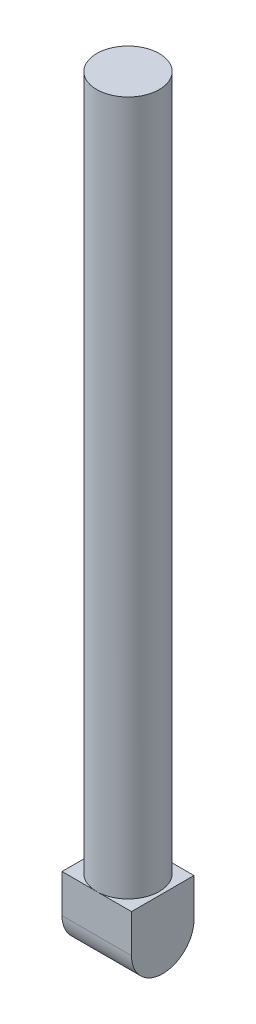
ISO-10303-21;
HEADER;
FILE_DESCRIPTION(('STEP AP214'),'2;1');
FILE_NAME('part.step','',(''),(''),'','','');
FILE_SCHEMA(('AUTOMOTIVE_DESIGN { 1 0 10303 214 1 1 1 1 }'));
ENDSEC;
DATA;
#1=APPLICATION_CONTEXT('core data for automotive mechanical design processes');
#2=APPLICATION_PROTOCOL_DEFINITION('international standard','automotive_design',2000,#1);
#3=PRODUCT_CONTEXT('',#1,'mechanical');
#4=PRODUCT('Part','Part','',(#3));
#5=PRODUCT_RELATED_PRODUCT_CATEGORY('part','',(#4));
#6=PRODUCT_DEFINITION_FORMATION('','',#4);
#7=PRODUCT_DEFINITION_CONTEXT('part definition',#1,'design');
#8=PRODUCT_DEFINITION('design','',#6,#7);
#9=PRODUCT_DEFINITION_SHAPE('','',#8);
#10=(LENGTH_UNIT() NAMED_UNIT(*) SI_UNIT(.MILLI.,.METRE.));
#11=(NAMED_UNIT(*) PLANE_ANGLE_UNIT() SI_UNIT($,.RADIAN.));
#12=(NAMED_UNIT(*) SI_UNIT($,.STERADIAN.) SOLID_ANGLE_UNIT());
#13=UNCERTAINTY_MEASURE_WITH_UNIT(LENGTH_MEASURE(1.E-05),#10,'distance_accuracy_value','');
#14=(GEOMETRIC_REPRESENTATION_CONTEXT(3) GLOBAL_UNCERTAINTY_ASSIGNED_CONTEXT((#13)) GLOBAL_UNIT_ASSIGNED_CONTEXT((#10,
#11,#12)) REPRESENTATION_CONTEXT('',''));
#15=CARTESIAN_POINT('',(0.,0.,0.));
#16=DIRECTION('',(0.,0.,1.));
#17=DIRECTION('',(1.,0.,0.));
#18=AXIS2_PLACEMENT_3D('',#15,#16,#17);
#19=CARTESIAN_POINT('',(-10.,20.,-9.));
#20=DIRECTION('',(0.,0.,1.));
#21=DIRECTION('',(1.,0.,0.));
#22=AXIS2_PLACEMENT_3D('',#19,#20,#21);
#23=PLANE('',#22);
#24=DIRECTION('',(-1.,0.,0.));
#25=VECTOR('',#24,1.);
#26=CARTESIAN_POINT('',(90.,9.,-9.00000000000002));
#27=LINE('',#26,#25);
#28=CARTESIAN_POINT('',(9.99999999999999,9.,-9.));
#29=VERTEX_POINT('',#28);
#30=CARTESIAN_POINT('',(-10.,9.,-9.));
#31=VERTEX_POINT('',#30);
#32=EDGE_CURVE('E84',#29,#31,#27,.T.);
#33=ORIENTED_EDGE('',*,*,#32,.T.);
#34=DIRECTION('',(0.,-1.,0.));
#35=VECTOR('',#34,1.);
#36=CARTESIAN_POINT('',(-10.,20.,-9.));
#37=LINE('',#36,#35);
#38=CARTESIAN_POINT('',(-10.,20.,-9.));
#39=VERTEX_POINT('',#38);
#40=EDGE_CURVE('E83',#39,#31,#37,.T.);
#41=ORIENTED_EDGE('',*,*,#40,.F.);
#42=DIRECTION('',(-1.,0.,0.));
#43=VECTOR('',#42,1.);
#44=CARTESIAN_POINT('',(-10.,20.,-9.));
#45=LINE('',#44,#43);
#46=CARTESIAN_POINT('',(0.,20.,-9.));
#47=VERTEX_POINT('',#46);
#48=EDGE_CURVE('E109',#47,#39,#45,.T.);
#49=ORIENTED_EDGE('',*,*,#48,.F.);
#50=CARTESIAN_POINT('',(10.,20.,-9.));
#51=VERTEX_POINT('',#50);
#52=EDGE_CURVE('E106',#51,#47,#45,.T.);
#53=ORIENTED_EDGE('',*,*,#52,.F.);
#54=DIRECTION('',(0.,-1.,0.));
#55=VECTOR('',#54,1.);
#56=CARTESIAN_POINT('',(10.,20.,-9.));
#57=LINE('',#56,#55);
#58=EDGE_CURVE('E99',#51,#29,#57,.T.);
#59=ORIENTED_EDGE('',*,*,#58,.T.);
#60=EDGE_LOOP('',(#33,#41,#49,#53,#59));
#61=FACE_BOUND('',#60,.T.);
#62=ADVANCED_FACE('F32',(#61),#23,.F.);
#63=CARTESIAN_POINT('',(0.,20.,0.));
#64=DIRECTION('',(0.,1.,0.));
#65=DIRECTION('',(0.,0.,1.));
#66=AXIS2_PLACEMENT_3D('',#63,#64,#65);
#67=PLANE('',#66);
#68=CARTESIAN_POINT('',(0.,20.,0.));
#69=DIRECTION('',(0.,1.,0.));
#70=DIRECTION('',(0.,0.,1.));
#71=AXIS2_PLACEMENT_3D('',#68,#69,#70);
#72=CIRCLE('',#71,9.);
#73=CARTESIAN_POINT('',(0.,20.,9.));
#74=VERTEX_POINT('',#73);
#75=EDGE_CURVE('E42',#74,#47,#72,.T.);
#76=ORIENTED_EDGE('',*,*,#75,.F.);
#77=DIRECTION('',(1.,0.,0.));
#78=VECTOR('',#77,1.);
#79=CARTESIAN_POINT('',(-10.,20.,9.));
#80=LINE('',#79,#78);
#81=CARTESIAN_POINT('',(10.,20.,9.));
#82=VERTEX_POINT('',#81);
#83=EDGE_CURVE('E113',#74,#82,#80,.T.);
#84=ORIENTED_EDGE('',*,*,#83,.T.);
#85=DIRECTION('',(0.,0.,-1.));
#86=VECTOR('',#85,1.);
#87=CARTESIAN_POINT('',(10.,20.,-9.));
#88=LINE('',#87,#86);
#89=EDGE_CURVE('E110',#82,#51,#88,.T.);
#90=ORIENTED_EDGE('',*,*,#89,.T.);
#91=ORIENTED_EDGE('',*,*,#52,.T.);
#92=EDGE_LOOP('',(#76,#84,#90,#91));
#93=FACE_BOUND('',#92,.T.);
#94=ADVANCED_FACE('F127',(#93),#67,.T.);
#95=CARTESIAN_POINT('',(-10.,20.,-9.));
#96=DIRECTION('',(1.,0.,0.));
#97=DIRECTION('',(0.,0.,-1.));
#98=AXIS2_PLACEMENT_3D('',#95,#96,#97);
#99=PLANE('',#98);
#100=ORIENTED_EDGE('',*,*,#40,.T.);
#101=CARTESIAN_POINT('',(-10.,9.,0.));
#102=DIRECTION('',(1.,0.,0.));
#103=DIRECTION('',(0.,0.,1.));
#104=AXIS2_PLACEMENT_3D('',#101,#102,#103);
#105=CIRCLE('',#104,9.);
#106=CARTESIAN_POINT('',(-10.,9.,9.));
#107=VERTEX_POINT('',#106);
#108=EDGE_CURVE('E49',#107,#31,#105,.T.);
#109=ORIENTED_EDGE('',*,*,#108,.F.);
#110=DIRECTION('',(0.,-1.,0.));
#111=VECTOR('',#110,1.);
#112=CARTESIAN_POINT('',(-10.,20.,9.));
#113=LINE('',#112,#111);
#114=CARTESIAN_POINT('',(-10.,20.,9.));
#115=VERTEX_POINT('',#114);
#116=EDGE_CURVE('E36',#115,#107,#113,.T.);
#117=ORIENTED_EDGE('',*,*,#116,.F.);
#118=DIRECTION('',(0.,0.,1.));
#119=VECTOR('',#118,1.);
#120=CARTESIAN_POINT('',(-10.,20.,-9.));
#121=LINE('',#120,#119);
#122=EDGE_CURVE('E114',#39,#115,#121,.T.);
#123=ORIENTED_EDGE('',*,*,#122,.F.);
#124=EDGE_LOOP('',(#100,#109,#117,#123));
#125=FACE_BOUND('',#124,.T.);
#126=ADVANCED_FACE('F34',(#125),#99,.F.);
#127=CARTESIAN_POINT('',(-10.,20.,9.));
#128=DIRECTION('',(0.,0.,-1.));
#129=DIRECTION('',(-1.,0.,0.));
#130=AXIS2_PLACEMENT_3D('',#127,#128,#129);
#131=PLANE('',#130);
#132=ORIENTED_EDGE('',*,*,#116,.T.);
#133=DIRECTION('',(-1.,0.,0.));
#134=VECTOR('',#133,1.);
#135=CARTESIAN_POINT('',(90.,9.,8.99999999999998));
#136=LINE('',#135,#134);
#137=CARTESIAN_POINT('',(9.99999999999999,9.,9.));
#138=VERTEX_POINT('',#137);
#139=EDGE_CURVE('E87',#138,#107,#136,.T.);
#140=ORIENTED_EDGE('',*,*,#139,.F.);
#141=DIRECTION('',(0.,-1.,0.));
#142=VECTOR('',#141,1.);
#143=CARTESIAN_POINT('',(10.,20.,9.));
#144=LINE('',#143,#142);
#145=EDGE_CURVE('E98',#82,#138,#144,.T.);
#146=ORIENTED_EDGE('',*,*,#145,.F.);
#147=ORIENTED_EDGE('',*,*,#83,.F.);
#148=EDGE_CURVE('E96',#115,#74,#80,.T.);
#149=ORIENTED_EDGE('',*,*,#148,.F.);
#150=EDGE_LOOP('',(#132,#140,#146,#147,#149));
#151=FACE_BOUND('',#150,.T.);
#152=ADVANCED_FACE('F94',(#151),#131,.F.);
#153=CARTESIAN_POINT('',(10.,20.,-9.));
#154=DIRECTION('',(-1.,0.,0.));
#155=DIRECTION('',(0.,0.,1.));
#156=AXIS2_PLACEMENT_3D('',#153,#154,#155);
#157=PLANE('',#156);
#158=ORIENTED_EDGE('',*,*,#145,.T.);
#159=CARTESIAN_POINT('',(9.99999999999999,9.,0.));
#160=DIRECTION('',(-1.,0.,0.));
#161=DIRECTION('',(0.,0.,1.));
#162=AXIS2_PLACEMENT_3D('',#159,#160,#161);
#163=CIRCLE('',#162,9.);
#164=EDGE_CURVE('E89',#138,#29,#163,.F.);
#165=ORIENTED_EDGE('',*,*,#164,.T.);
#166=ORIENTED_EDGE('',*,*,#58,.F.);
#167=ORIENTED_EDGE('',*,*,#89,.F.);
#168=EDGE_LOOP('',(#158,#165,#166,#167));
#169=FACE_BOUND('',#168,.T.);
#170=ADVANCED_FACE('F124',(#169),#157,.F.);
#171=EDGE_CURVE('E11',#47,#74,#72,.T.);
#172=ORIENTED_EDGE('',*,*,#171,.F.);
#173=ORIENTED_EDGE('',*,*,#48,.T.);
#174=ORIENTED_EDGE('',*,*,#122,.T.);
#175=ORIENTED_EDGE('',*,*,#148,.T.);
#176=EDGE_LOOP('',(#172,#173,#174,#175));
#177=FACE_BOUND('',#176,.T.);
#178=ADVANCED_FACE('F132',(#177),#67,.T.);
#179=CARTESIAN_POINT('',(0.,220.,0.));
#180=DIRECTION('',(0.,-1.,0.));
#181=DIRECTION('',(0.,0.,-1.));
#182=AXIS2_PLACEMENT_3D('',#179,#180,#181);
#183=CYLINDRICAL_SURFACE('',#182,9.);
#184=CARTESIAN_POINT('',(0.,220.,0.));
#185=DIRECTION('',(0.,1.,0.));
#186=DIRECTION('',(0.,0.,1.));
#187=AXIS2_PLACEMENT_3D('',#184,#185,#186);
#188=CIRCLE('',#187,9.);
#189=CARTESIAN_POINT('',(0.,220.,9.));
#190=VERTEX_POINT('',#189);
#191=EDGE_CURVE('E115',#190,#190,#188,.T.);
#192=ORIENTED_EDGE('',*,*,#191,.F.);
#193=EDGE_LOOP('',(#192));
#194=FACE_BOUND('',#193,.T.);
#195=ORIENTED_EDGE('',*,*,#75,.T.);
#196=ORIENTED_EDGE('',*,*,#171,.T.);
#197=EDGE_LOOP('',(#195,#196));
#198=FACE_BOUND('',#197,.T.);
#199=ADVANCED_FACE('F129',(#194,#198),#183,.T.);
#200=CARTESIAN_POINT('',(0.,220.,0.));
#201=DIRECTION('',(0.,1.,0.));
#202=DIRECTION('',(0.,0.,1.));
#203=AXIS2_PLACEMENT_3D('',#200,#201,#202);
#204=PLANE('',#203);
#205=ORIENTED_EDGE('',*,*,#191,.T.);
#206=EDGE_LOOP('',(#205));
#207=FACE_BOUND('',#206,.T.);
#208=ADVANCED_FACE('F131',(#207),#204,.T.);
#209=CARTESIAN_POINT('',(90.,9.,0.));
#210=DIRECTION('',(-1.,0.,0.));
#211=DIRECTION('',(0.,0.,1.));
#212=AXIS2_PLACEMENT_3D('',#209,#210,#211);
#213=CYLINDRICAL_SURFACE('',#212,9.);
#214=ORIENTED_EDGE('',*,*,#139,.T.);
#215=ORIENTED_EDGE('',*,*,#108,.T.);
#216=ORIENTED_EDGE('',*,*,#32,.F.);
#217=ORIENTED_EDGE('',*,*,#164,.F.);
#218=EDGE_LOOP('',(#214,#215,#216,#217));
#219=FACE_BOUND('',#218,.T.);
#220=ADVANCED_FACE('F88',(#219),#213,.T.);
#221=CLOSED_SHELL('',(#62,#94,#126,#152,#170,#178,#199,#208,#220));
#222=MANIFOLD_SOLID_BREP('B2',#221);
#223=ADVANCED_BREP_SHAPE_REPRESENTATION('',(#18,#222),#14);
#224=SHAPE_DEFINITION_REPRESENTATION(#9,#223);
ENDSEC;
END-ISO-10303-21;
